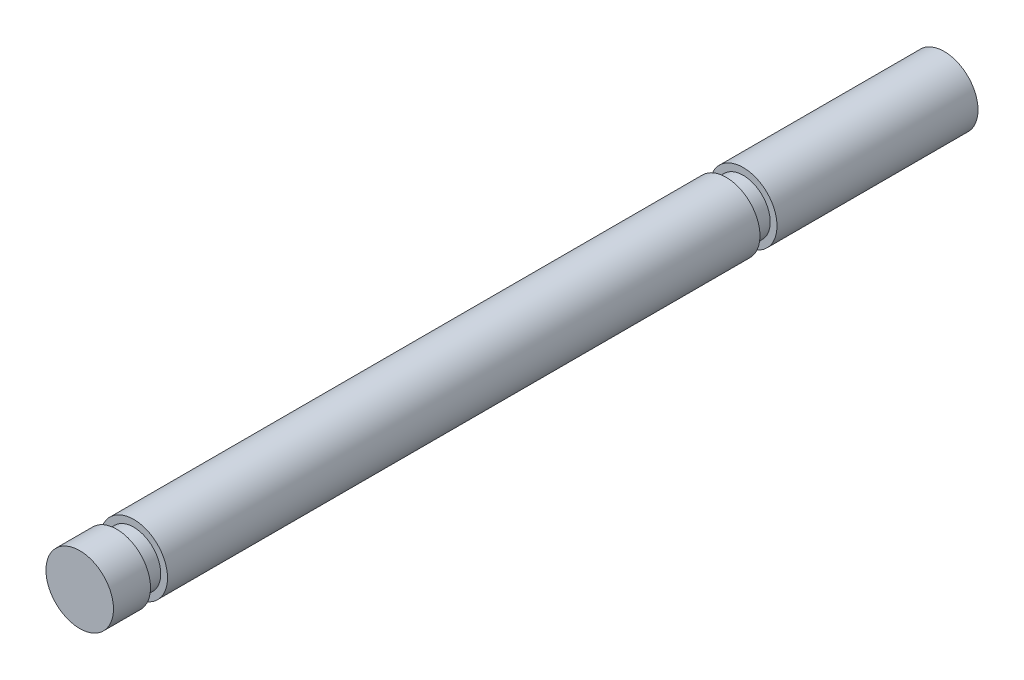
ISO-10303-21;
HEADER;
FILE_DESCRIPTION(('STEP AP214'),'2;1');
FILE_NAME('part.step','',(''),(''),'','','');
FILE_SCHEMA(('AUTOMOTIVE_DESIGN { 1 0 10303 214 1 1 1 1 }'));
ENDSEC;
DATA;
#1=APPLICATION_CONTEXT('core data for automotive mechanical design processes');
#2=APPLICATION_PROTOCOL_DEFINITION('international standard','automotive_design',2000,#1);
#3=PRODUCT_CONTEXT('',#1,'mechanical');
#4=PRODUCT('Part','Part','',(#3));
#5=PRODUCT_RELATED_PRODUCT_CATEGORY('part','',(#4));
#6=PRODUCT_DEFINITION_FORMATION('','',#4);
#7=PRODUCT_DEFINITION_CONTEXT('part definition',#1,'design');
#8=PRODUCT_DEFINITION('design','',#6,#7);
#9=PRODUCT_DEFINITION_SHAPE('','',#8);
#10=(LENGTH_UNIT() NAMED_UNIT(*) SI_UNIT(.MILLI.,.METRE.));
#11=(NAMED_UNIT(*) PLANE_ANGLE_UNIT() SI_UNIT($,.RADIAN.));
#12=(NAMED_UNIT(*) SI_UNIT($,.STERADIAN.) SOLID_ANGLE_UNIT());
#13=UNCERTAINTY_MEASURE_WITH_UNIT(LENGTH_MEASURE(1.E-05),#10,'distance_accuracy_value','');
#14=(GEOMETRIC_REPRESENTATION_CONTEXT(3) GLOBAL_UNCERTAINTY_ASSIGNED_CONTEXT((#13)) GLOBAL_UNIT_ASSIGNED_CONTEXT((#10,
#11,#12)) REPRESENTATION_CONTEXT('',''));
#15=CARTESIAN_POINT('',(0.,0.,0.));
#16=DIRECTION('',(0.,0.,1.));
#17=DIRECTION('',(1.,0.,0.));
#18=AXIS2_PLACEMENT_3D('',#15,#16,#17);
#19=CARTESIAN_POINT('',(0.,0.,81.28));
#20=DIRECTION('',(0.,0.,-1.));
#21=DIRECTION('',(-1.,0.,0.));
#22=AXIS2_PLACEMENT_3D('',#19,#20,#21);
#23=CYLINDRICAL_SURFACE('',#22,3.175);
#24=CARTESIAN_POINT('',(0.,0.,20.4977999999997));
#25=DIRECTION('',(0.,0.,-1.));
#26=DIRECTION('',(-1.,0.,0.));
#27=AXIS2_PLACEMENT_3D('',#24,#25,#26);
#28=CIRCLE('',#27,3.175);
#29=CARTESIAN_POINT('',(-3.175,0.,20.4977999999997));
#30=VERTEX_POINT('',#29);
#31=EDGE_CURVE('E51',#30,#30,#28,.T.);
#32=ORIENTED_EDGE('',*,*,#31,.F.);
#33=EDGE_LOOP('',(#32));
#34=FACE_BOUND('',#33,.T.);
#35=CARTESIAN_POINT('',(0.,0.,76.1999999999997));
#36=DIRECTION('',(0.,0.,1.));
#37=DIRECTION('',(1.,0.,0.));
#38=AXIS2_PLACEMENT_3D('',#35,#36,#37);
#39=CIRCLE('',#38,3.175);
#40=CARTESIAN_POINT('',(3.175,0.,76.1999999999997));
#41=VERTEX_POINT('',#40);
#42=EDGE_CURVE('E56',#41,#41,#39,.T.);
#43=ORIENTED_EDGE('',*,*,#42,.F.);
#44=EDGE_LOOP('',(#43));
#45=FACE_BOUND('',#44,.T.);
#46=ADVANCED_FACE('F32',(#34,#45),#23,.T.);
#47=CARTESIAN_POINT('',(0.,0.,18.8975999999997));
#48=DIRECTION('',(0.,0.,-1.));
#49=DIRECTION('',(-1.,0.,0.));
#50=AXIS2_PLACEMENT_3D('',#47,#48,#49);
#51=CIRCLE('',#50,3.175);
#52=CARTESIAN_POINT('',(-3.175,0.,18.8975999999997));
#53=VERTEX_POINT('',#52);
#54=EDGE_CURVE('E45',#53,#53,#51,.T.);
#55=ORIENTED_EDGE('',*,*,#54,.T.);
#56=EDGE_LOOP('',(#55));
#57=FACE_BOUND('',#56,.T.);
#58=CARTESIAN_POINT('',(0.,0.,0.));
#59=DIRECTION('',(0.,0.,1.));
#60=DIRECTION('',(1.,0.,0.));
#61=AXIS2_PLACEMENT_3D('',#58,#59,#60);
#62=CIRCLE('',#61,3.175);
#63=CARTESIAN_POINT('',(3.175,0.,0.));
#64=VERTEX_POINT('',#63);
#65=EDGE_CURVE('E40',#64,#64,#62,.T.);
#66=ORIENTED_EDGE('',*,*,#65,.T.);
#67=EDGE_LOOP('',(#66));
#68=FACE_BOUND('',#67,.T.);
#69=ADVANCED_FACE('F34',(#57,#68),#23,.T.);
#70=CARTESIAN_POINT('',(0.,0.,0.));
#71=DIRECTION('',(0.,0.,1.));
#72=DIRECTION('',(1.,0.,0.));
#73=AXIS2_PLACEMENT_3D('',#70,#71,#72);
#74=PLANE('',#73);
#75=ORIENTED_EDGE('',*,*,#65,.F.);
#76=EDGE_LOOP('',(#75));
#77=FACE_BOUND('',#76,.T.);
#78=ADVANCED_FACE('F90',(#77),#74,.F.);
#79=CARTESIAN_POINT('',(0.,0.,18.8975999999997));
#80=DIRECTION('',(0.,0.,-1.));
#81=DIRECTION('',(-1.,0.,0.));
#82=AXIS2_PLACEMENT_3D('',#79,#80,#81);
#83=PLANE('',#82);
#84=CARTESIAN_POINT('',(0.,0.,18.8975999999997));
#85=DIRECTION('',(0.,0.,-1.));
#86=DIRECTION('',(-1.,0.,0.));
#87=AXIS2_PLACEMENT_3D('',#84,#85,#86);
#88=CIRCLE('',#87,2.54);
#89=CARTESIAN_POINT('',(-2.54,0.,18.8975999999997));
#90=VERTEX_POINT('',#89);
#91=EDGE_CURVE('E54',#90,#90,#88,.T.);
#92=ORIENTED_EDGE('',*,*,#91,.T.);
#93=EDGE_LOOP('',(#92));
#94=FACE_BOUND('',#93,.T.);
#95=ORIENTED_EDGE('',*,*,#54,.F.);
#96=EDGE_LOOP('',(#95));
#97=FACE_BOUND('',#96,.T.);
#98=ADVANCED_FACE('F80',(#94,#97),#83,.F.);
#99=CARTESIAN_POINT('',(0.,0.,20.4977999999997));
#100=DIRECTION('',(0.,0.,-1.));
#101=DIRECTION('',(-1.,0.,0.));
#102=AXIS2_PLACEMENT_3D('',#99,#100,#101);
#103=PLANE('',#102);
#104=CARTESIAN_POINT('',(0.,0.,20.4977999999997));
#105=DIRECTION('',(0.,0.,-1.));
#106=DIRECTION('',(-1.,0.,0.));
#107=AXIS2_PLACEMENT_3D('',#104,#105,#106);
#108=CIRCLE('',#107,2.54);
#109=CARTESIAN_POINT('',(-2.54,0.,20.4977999999997));
#110=VERTEX_POINT('',#109);
#111=EDGE_CURVE('E48',#110,#110,#108,.T.);
#112=ORIENTED_EDGE('',*,*,#111,.F.);
#113=EDGE_LOOP('',(#112));
#114=FACE_BOUND('',#113,.T.);
#115=ORIENTED_EDGE('',*,*,#31,.T.);
#116=EDGE_LOOP('',(#115));
#117=FACE_BOUND('',#116,.T.);
#118=ADVANCED_FACE('F77',(#114,#117),#103,.T.);
#119=CARTESIAN_POINT('',(0.,0.,18.8975999999997));
#120=DIRECTION('',(0.,0.,1.));
#121=DIRECTION('',(1.,0.,0.));
#122=AXIS2_PLACEMENT_3D('',#119,#120,#121);
#123=CYLINDRICAL_SURFACE('',#122,2.54);
#124=ORIENTED_EDGE('',*,*,#91,.F.);
#125=EDGE_LOOP('',(#124));
#126=FACE_BOUND('',#125,.T.);
#127=ORIENTED_EDGE('',*,*,#111,.T.);
#128=EDGE_LOOP('',(#127));
#129=FACE_BOUND('',#128,.T.);
#130=ADVANCED_FACE('F75',(#126,#129),#123,.T.);
#131=CARTESIAN_POINT('',(0.,0.,77.8001999999997));
#132=DIRECTION('',(0.,0.,1.));
#133=DIRECTION('',(1.,0.,0.));
#134=AXIS2_PLACEMENT_3D('',#131,#132,#133);
#135=PLANE('',#134);
#136=CARTESIAN_POINT('',(0.,0.,77.8001999999997));
#137=DIRECTION('',(0.,0.,1.));
#138=DIRECTION('',(1.,0.,0.));
#139=AXIS2_PLACEMENT_3D('',#136,#137,#138);
#140=CIRCLE('',#139,2.54);
#141=CARTESIAN_POINT('',(2.54,0.,77.8001999999997));
#142=VERTEX_POINT('',#141);
#143=EDGE_CURVE('E58',#142,#142,#140,.T.);
#144=ORIENTED_EDGE('',*,*,#143,.T.);
#145=EDGE_LOOP('',(#144));
#146=FACE_BOUND('',#145,.T.);
#147=CARTESIAN_POINT('',(0.,0.,77.8001999999997));
#148=DIRECTION('',(0.,0.,1.));
#149=DIRECTION('',(1.,0.,0.));
#150=AXIS2_PLACEMENT_3D('',#147,#148,#149);
#151=CIRCLE('',#150,3.175);
#152=CARTESIAN_POINT('',(3.175,0.,77.8001999999997));
#153=VERTEX_POINT('',#152);
#154=EDGE_CURVE('E36',#153,#153,#151,.T.);
#155=ORIENTED_EDGE('',*,*,#154,.F.);
#156=EDGE_LOOP('',(#155));
#157=FACE_BOUND('',#156,.T.);
#158=ADVANCED_FACE('F103',(#146,#157),#135,.F.);
#159=CARTESIAN_POINT('',(0.,0.,76.1999999999997));
#160=DIRECTION('',(0.,0.,1.));
#161=DIRECTION('',(1.,0.,0.));
#162=AXIS2_PLACEMENT_3D('',#159,#160,#161);
#163=PLANE('',#162);
#164=CARTESIAN_POINT('',(0.,0.,76.1999999999997));
#165=DIRECTION('',(0.,0.,1.));
#166=DIRECTION('',(1.,0.,0.));
#167=AXIS2_PLACEMENT_3D('',#164,#165,#166);
#168=CIRCLE('',#167,2.54);
#169=CARTESIAN_POINT('',(2.54,0.,76.1999999999997));
#170=VERTEX_POINT('',#169);
#171=EDGE_CURVE('E63',#170,#170,#168,.T.);
#172=ORIENTED_EDGE('',*,*,#171,.F.);
#173=EDGE_LOOP('',(#172));
#174=FACE_BOUND('',#173,.T.);
#175=ORIENTED_EDGE('',*,*,#42,.T.);
#176=EDGE_LOOP('',(#175));
#177=FACE_BOUND('',#176,.T.);
#178=ADVANCED_FACE('F105',(#174,#177),#163,.T.);
#179=CARTESIAN_POINT('',(0.,0.,77.8001999999997));
#180=DIRECTION('',(0.,0.,-1.));
#181=DIRECTION('',(-1.,0.,0.));
#182=AXIS2_PLACEMENT_3D('',#179,#180,#181);
#183=CYLINDRICAL_SURFACE('',#182,2.54);
#184=ORIENTED_EDGE('',*,*,#143,.F.);
#185=EDGE_LOOP('',(#184));
#186=FACE_BOUND('',#185,.T.);
#187=ORIENTED_EDGE('',*,*,#171,.T.);
#188=EDGE_LOOP('',(#187));
#189=FACE_BOUND('',#188,.T.);
#190=ADVANCED_FACE('F98',(#186,#189),#183,.T.);
#191=CARTESIAN_POINT('',(0.,0.,81.28));
#192=DIRECTION('',(0.,0.,1.));
#193=DIRECTION('',(1.,0.,0.));
#194=AXIS2_PLACEMENT_3D('',#191,#192,#193);
#195=PLANE('',#194);
#196=CARTESIAN_POINT('',(0.,0.,81.28));
#197=DIRECTION('',(0.,0.,1.));
#198=DIRECTION('',(1.,0.,0.));
#199=AXIS2_PLACEMENT_3D('',#196,#197,#198);
#200=CIRCLE('',#199,3.175);
#201=CARTESIAN_POINT('',(3.175,0.,81.28));
#202=VERTEX_POINT('',#201);
#203=EDGE_CURVE('E11',#202,#202,#200,.T.);
#204=ORIENTED_EDGE('',*,*,#203,.T.);
#205=EDGE_LOOP('',(#204));
#206=FACE_BOUND('',#205,.T.);
#207=ADVANCED_FACE('F93',(#206),#195,.T.);
#208=ORIENTED_EDGE('',*,*,#154,.T.);
#209=EDGE_LOOP('',(#208));
#210=FACE_BOUND('',#209,.T.);
#211=ORIENTED_EDGE('',*,*,#203,.F.);
#212=EDGE_LOOP('',(#211));
#213=FACE_BOUND('',#212,.T.);
#214=ADVANCED_FACE('F86',(#210,#213),#23,.T.);
#215=CLOSED_SHELL('',(#46,#69,#78,#98,#118,#130,#158,#178,#190,#207,#214));
#216=MANIFOLD_SOLID_BREP('B2',#215);
#217=ADVANCED_BREP_SHAPE_REPRESENTATION('',(#18,#216),#14);
#218=SHAPE_DEFINITION_REPRESENTATION(#9,#217);
ENDSEC;
END-ISO-10303-21;
